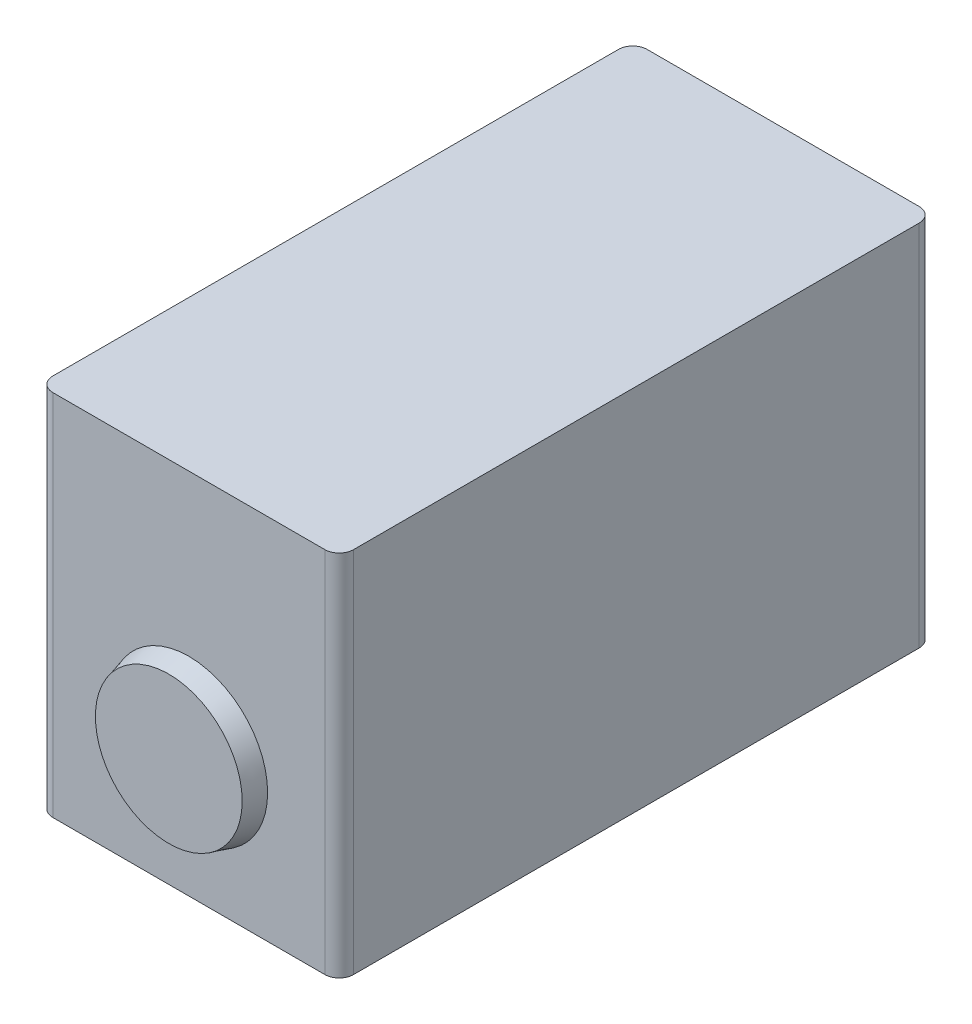
ISO-10303-21;
HEADER;
FILE_DESCRIPTION(('STEP AP214'),'2;1');
FILE_NAME('part.step','',(''),(''),'','','');
FILE_SCHEMA(('AUTOMOTIVE_DESIGN { 1 0 10303 214 1 1 1 1 }'));
ENDSEC;
DATA;
#1=APPLICATION_CONTEXT('core data for automotive mechanical design processes');
#2=APPLICATION_PROTOCOL_DEFINITION('international standard','automotive_design',2000,#1);
#3=PRODUCT_CONTEXT('',#1,'mechanical');
#4=PRODUCT('Part','Part','',(#3));
#5=PRODUCT_RELATED_PRODUCT_CATEGORY('part','',(#4));
#6=PRODUCT_DEFINITION_FORMATION('','',#4);
#7=PRODUCT_DEFINITION_CONTEXT('part definition',#1,'design');
#8=PRODUCT_DEFINITION('design','',#6,#7);
#9=PRODUCT_DEFINITION_SHAPE('','',#8);
#10=(LENGTH_UNIT() NAMED_UNIT(*) SI_UNIT(.MILLI.,.METRE.));
#11=(NAMED_UNIT(*) PLANE_ANGLE_UNIT() SI_UNIT($,.RADIAN.));
#12=(NAMED_UNIT(*) SI_UNIT($,.STERADIAN.) SOLID_ANGLE_UNIT());
#13=UNCERTAINTY_MEASURE_WITH_UNIT(LENGTH_MEASURE(1.E-05),#10,'distance_accuracy_value','');
#14=(GEOMETRIC_REPRESENTATION_CONTEXT(3) GLOBAL_UNCERTAINTY_ASSIGNED_CONTEXT((#13)) GLOBAL_UNIT_ASSIGNED_CONTEXT((#10,
#11,#12)) REPRESENTATION_CONTEXT('',''));
#15=CARTESIAN_POINT('',(0.,0.,0.));
#16=DIRECTION('',(0.,0.,1.));
#17=DIRECTION('',(1.,0.,0.));
#18=AXIS2_PLACEMENT_3D('',#15,#16,#17);
#19=CARTESIAN_POINT('',(10.5,25.7,20.75));
#20=DIRECTION('',(0.,0.,-1.));
#21=DIRECTION('',(-1.,0.,0.));
#22=AXIS2_PLACEMENT_3D('',#19,#20,#21);
#23=PLANE('',#22);
#24=DIRECTION('',(1.,0.,0.));
#25=VECTOR('',#24,1.);
#26=CARTESIAN_POINT('',(10.5,25.7,20.75));
#27=LINE('',#26,#25);
#28=CARTESIAN_POINT('',(-9.5,25.7,20.75));
#29=VERTEX_POINT('',#28);
#30=CARTESIAN_POINT('',(9.5,25.7,20.75));
#31=VERTEX_POINT('',#30);
#32=EDGE_CURVE('E181',#29,#31,#27,.T.);
#33=ORIENTED_EDGE('',*,*,#32,.F.);
#34=DIRECTION('',(0.,-1.,0.));
#35=VECTOR('',#34,1.);
#36=CARTESIAN_POINT('',(-9.50000000000001,25.7,20.75));
#37=LINE('',#36,#35);
#38=CARTESIAN_POINT('',(-9.5,0.,20.75));
#39=VERTEX_POINT('',#38);
#40=EDGE_CURVE('E50',#29,#39,#37,.T.);
#41=ORIENTED_EDGE('',*,*,#40,.T.);
#42=DIRECTION('',(1.,0.,0.));
#43=VECTOR('',#42,1.);
#44=CARTESIAN_POINT('',(10.5,0.,20.75));
#45=LINE('',#44,#43);
#46=CARTESIAN_POINT('',(9.5,0.,20.75));
#47=VERTEX_POINT('',#46);
#48=EDGE_CURVE('E137',#39,#47,#45,.T.);
#49=ORIENTED_EDGE('',*,*,#48,.T.);
#50=DIRECTION('',(0.,-1.,0.));
#51=VECTOR('',#50,1.);
#52=CARTESIAN_POINT('',(9.5,25.7,20.75));
#53=LINE('',#52,#51);
#54=EDGE_CURVE('E174',#47,#31,#53,.F.);
#55=ORIENTED_EDGE('',*,*,#54,.T.);
#56=EDGE_LOOP('',(#33,#41,#49,#55));
#57=FACE_BOUND('',#56,.T.);
#58=CARTESIAN_POINT('',(0.,9.,20.75));
#59=DIRECTION('',(0.,0.,-1.));
#60=DIRECTION('',(-1.,0.,0.));
#61=AXIS2_PLACEMENT_3D('',#58,#59,#60);
#62=CIRCLE('',#61,5.5);
#63=CARTESIAN_POINT('',(-5.5,9.,20.75));
#64=VERTEX_POINT('',#63);
#65=EDGE_CURVE('E11',#64,#64,#62,.F.);
#66=ORIENTED_EDGE('',*,*,#65,.F.);
#67=EDGE_LOOP('',(#66));
#68=FACE_BOUND('',#67,.T.);
#69=ADVANCED_FACE('F42',(#57,#68),#23,.F.);
#70=CARTESIAN_POINT('',(-10.5,25.7,20.75));
#71=DIRECTION('',(1.,0.,0.));
#72=DIRECTION('',(0.,0.,-1.));
#73=AXIS2_PLACEMENT_3D('',#70,#71,#72);
#74=PLANE('',#73);
#75=DIRECTION('',(0.,0.,1.));
#76=VECTOR('',#75,1.);
#77=CARTESIAN_POINT('',(-10.5,25.7,20.75));
#78=LINE('',#77,#76);
#79=CARTESIAN_POINT('',(-10.5,25.7,-19.75));
#80=VERTEX_POINT('',#79);
#81=CARTESIAN_POINT('',(-10.5,25.7,19.75));
#82=VERTEX_POINT('',#81);
#83=EDGE_CURVE('E130',#80,#82,#78,.T.);
#84=ORIENTED_EDGE('',*,*,#83,.F.);
#85=DIRECTION('',(0.,-1.,0.));
#86=VECTOR('',#85,1.);
#87=CARTESIAN_POINT('',(-10.5,25.7,-19.75));
#88=LINE('',#87,#86);
#89=CARTESIAN_POINT('',(-10.5,0.,-19.75));
#90=VERTEX_POINT('',#89);
#91=EDGE_CURVE('E114',#80,#90,#88,.T.);
#92=ORIENTED_EDGE('',*,*,#91,.T.);
#93=DIRECTION('',(0.,0.,1.));
#94=VECTOR('',#93,1.);
#95=CARTESIAN_POINT('',(-10.5,0.,20.75));
#96=LINE('',#95,#94);
#97=CARTESIAN_POINT('',(-10.5,0.,19.75));
#98=VERTEX_POINT('',#97);
#99=EDGE_CURVE('E127',#90,#98,#96,.T.);
#100=ORIENTED_EDGE('',*,*,#99,.T.);
#101=DIRECTION('',(0.,-1.,0.));
#102=VECTOR('',#101,1.);
#103=CARTESIAN_POINT('',(-10.5,25.7,19.75));
#104=LINE('',#103,#102);
#105=EDGE_CURVE('E132',#98,#82,#104,.F.);
#106=ORIENTED_EDGE('',*,*,#105,.T.);
#107=EDGE_LOOP('',(#84,#92,#100,#106));
#108=FACE_BOUND('',#107,.T.);
#109=ADVANCED_FACE('F126',(#108),#74,.F.);
#110=CARTESIAN_POINT('',(10.5,25.7,20.75));
#111=DIRECTION('',(-1.,0.,0.));
#112=DIRECTION('',(0.,0.,1.));
#113=AXIS2_PLACEMENT_3D('',#110,#111,#112);
#114=PLANE('',#113);
#115=DIRECTION('',(0.,0.,-1.));
#116=VECTOR('',#115,1.);
#117=CARTESIAN_POINT('',(10.5,0.,20.75));
#118=LINE('',#117,#116);
#119=CARTESIAN_POINT('',(10.5,0.,19.75));
#120=VERTEX_POINT('',#119);
#121=CARTESIAN_POINT('',(10.5,0.,-19.75));
#122=VERTEX_POINT('',#121);
#123=EDGE_CURVE('E141',#120,#122,#118,.T.);
#124=ORIENTED_EDGE('',*,*,#123,.T.);
#125=DIRECTION('',(0.,-1.,0.));
#126=VECTOR('',#125,1.);
#127=CARTESIAN_POINT('',(10.5,25.7,-19.75));
#128=LINE('',#127,#126);
#129=CARTESIAN_POINT('',(10.5,25.7,-19.75));
#130=VERTEX_POINT('',#129);
#131=EDGE_CURVE('E57',#122,#130,#128,.F.);
#132=ORIENTED_EDGE('',*,*,#131,.T.);
#133=DIRECTION('',(0.,0.,-1.));
#134=VECTOR('',#133,1.);
#135=CARTESIAN_POINT('',(10.5,25.7,20.75));
#136=LINE('',#135,#134);
#137=CARTESIAN_POINT('',(10.5,25.7,19.75));
#138=VERTEX_POINT('',#137);
#139=EDGE_CURVE('E188',#138,#130,#136,.T.);
#140=ORIENTED_EDGE('',*,*,#139,.F.);
#141=DIRECTION('',(0.,-1.,0.));
#142=VECTOR('',#141,1.);
#143=CARTESIAN_POINT('',(10.5,25.7,19.75));
#144=LINE('',#143,#142);
#145=EDGE_CURVE('E169',#138,#120,#144,.T.);
#146=ORIENTED_EDGE('',*,*,#145,.T.);
#147=EDGE_LOOP('',(#124,#132,#140,#146));
#148=FACE_BOUND('',#147,.T.);
#149=ADVANCED_FACE('F187',(#148),#114,.F.);
#150=CARTESIAN_POINT('',(10.5,25.7,-20.75));
#151=DIRECTION('',(0.,0.,1.));
#152=DIRECTION('',(1.,0.,0.));
#153=AXIS2_PLACEMENT_3D('',#150,#151,#152);
#154=PLANE('',#153);
#155=DIRECTION('',(-1.,0.,0.));
#156=VECTOR('',#155,1.);
#157=CARTESIAN_POINT('',(10.5,0.,-20.75));
#158=LINE('',#157,#156);
#159=CARTESIAN_POINT('',(9.5,0.,-20.75));
#160=VERTEX_POINT('',#159);
#161=CARTESIAN_POINT('',(-9.5,0.,-20.75));
#162=VERTEX_POINT('',#161);
#163=EDGE_CURVE('E151',#160,#162,#158,.T.);
#164=ORIENTED_EDGE('',*,*,#163,.T.);
#165=DIRECTION('',(0.,-1.,0.));
#166=VECTOR('',#165,1.);
#167=CARTESIAN_POINT('',(-9.50000000000001,25.7,-20.75));
#168=LINE('',#167,#166);
#169=CARTESIAN_POINT('',(-9.5,25.7,-20.75));
#170=VERTEX_POINT('',#169);
#171=EDGE_CURVE('E115',#162,#170,#168,.F.);
#172=ORIENTED_EDGE('',*,*,#171,.T.);
#173=DIRECTION('',(-1.,0.,0.));
#174=VECTOR('',#173,1.);
#175=CARTESIAN_POINT('',(10.5,25.7,-20.75));
#176=LINE('',#175,#174);
#177=CARTESIAN_POINT('',(9.5,25.7,-20.75));
#178=VERTEX_POINT('',#177);
#179=EDGE_CURVE('E146',#178,#170,#176,.T.);
#180=ORIENTED_EDGE('',*,*,#179,.F.);
#181=DIRECTION('',(0.,-1.,0.));
#182=VECTOR('',#181,1.);
#183=CARTESIAN_POINT('',(9.5,25.7,-20.75));
#184=LINE('',#183,#182);
#185=EDGE_CURVE('E120',#178,#160,#184,.T.);
#186=ORIENTED_EDGE('',*,*,#185,.T.);
#187=EDGE_LOOP('',(#164,#172,#180,#186));
#188=FACE_BOUND('',#187,.T.);
#189=ADVANCED_FACE('F221',(#188),#154,.F.);
#190=CARTESIAN_POINT('',(-10.5,25.7,-20.75));
#191=DIRECTION('',(0.,1.,0.));
#192=DIRECTION('',(0.,0.,1.));
#193=AXIS2_PLACEMENT_3D('',#190,#191,#192);
#194=PLANE('',#193);
#195=ORIENTED_EDGE('',*,*,#179,.T.);
#196=CARTESIAN_POINT('',(-9.5,25.7,-19.75));
#197=DIRECTION('',(0.,1.,0.));
#198=DIRECTION('',(0.,0.,1.));
#199=AXIS2_PLACEMENT_3D('',#196,#197,#198);
#200=CIRCLE('',#199,1.);
#201=EDGE_CURVE('E167',#170,#80,#200,.T.);
#202=ORIENTED_EDGE('',*,*,#201,.T.);
#203=ORIENTED_EDGE('',*,*,#83,.T.);
#204=CARTESIAN_POINT('',(-9.50000000000001,25.7,19.75));
#205=DIRECTION('',(0.,1.,0.));
#206=DIRECTION('',(0.,0.,1.));
#207=AXIS2_PLACEMENT_3D('',#204,#205,#206);
#208=CIRCLE('',#207,1.);
#209=EDGE_CURVE('E163',#82,#29,#208,.T.);
#210=ORIENTED_EDGE('',*,*,#209,.T.);
#211=ORIENTED_EDGE('',*,*,#32,.T.);
#212=CARTESIAN_POINT('',(9.5,25.7,19.75));
#213=DIRECTION('',(0.,1.,0.));
#214=DIRECTION('',(0.,0.,1.));
#215=AXIS2_PLACEMENT_3D('',#212,#213,#214);
#216=CIRCLE('',#215,1.);
#217=EDGE_CURVE('E64',#31,#138,#216,.T.);
#218=ORIENTED_EDGE('',*,*,#217,.T.);
#219=ORIENTED_EDGE('',*,*,#139,.T.);
#220=CARTESIAN_POINT('',(9.5,25.7,-19.75));
#221=DIRECTION('',(0.,1.,0.));
#222=DIRECTION('',(0.,0.,1.));
#223=AXIS2_PLACEMENT_3D('',#220,#221,#222);
#224=CIRCLE('',#223,1.);
#225=EDGE_CURVE('E165',#130,#178,#224,.T.);
#226=ORIENTED_EDGE('',*,*,#225,.T.);
#227=EDGE_LOOP('',(#195,#202,#203,#210,#211,#218,#219,#226));
#228=FACE_BOUND('',#227,.T.);
#229=ADVANCED_FACE('F193',(#228),#194,.T.);
#230=CARTESIAN_POINT('',(-10.5,0.,-20.75));
#231=DIRECTION('',(0.,1.,0.));
#232=DIRECTION('',(0.,0.,1.));
#233=AXIS2_PLACEMENT_3D('',#230,#231,#232);
#234=PLANE('',#233);
#235=ORIENTED_EDGE('',*,*,#99,.F.);
#236=CARTESIAN_POINT('',(-9.5,0.,-19.75));
#237=DIRECTION('',(0.,1.,0.));
#238=DIRECTION('',(0.,0.,1.));
#239=AXIS2_PLACEMENT_3D('',#236,#237,#238);
#240=CIRCLE('',#239,1.);
#241=EDGE_CURVE('E110',#90,#162,#240,.F.);
#242=ORIENTED_EDGE('',*,*,#241,.T.);
#243=ORIENTED_EDGE('',*,*,#163,.F.);
#244=CARTESIAN_POINT('',(9.5,0.,-19.75));
#245=DIRECTION('',(0.,1.,0.));
#246=DIRECTION('',(0.,0.,1.));
#247=AXIS2_PLACEMENT_3D('',#244,#245,#246);
#248=CIRCLE('',#247,1.);
#249=EDGE_CURVE('E121',#160,#122,#248,.F.);
#250=ORIENTED_EDGE('',*,*,#249,.T.);
#251=ORIENTED_EDGE('',*,*,#123,.F.);
#252=CARTESIAN_POINT('',(9.5,0.,19.75));
#253=DIRECTION('',(0.,1.,0.));
#254=DIRECTION('',(0.,0.,1.));
#255=AXIS2_PLACEMENT_3D('',#252,#253,#254);
#256=CIRCLE('',#255,1.);
#257=EDGE_CURVE('E131',#120,#47,#256,.F.);
#258=ORIENTED_EDGE('',*,*,#257,.T.);
#259=ORIENTED_EDGE('',*,*,#48,.F.);
#260=CARTESIAN_POINT('',(-9.50000000000001,0.,19.75));
#261=DIRECTION('',(0.,1.,0.));
#262=DIRECTION('',(0.,0.,1.));
#263=AXIS2_PLACEMENT_3D('',#260,#261,#262);
#264=CIRCLE('',#263,1.);
#265=EDGE_CURVE('E136',#39,#98,#264,.F.);
#266=ORIENTED_EDGE('',*,*,#265,.T.);
#267=EDGE_LOOP('',(#235,#242,#243,#250,#251,#258,#259,#266));
#268=FACE_BOUND('',#267,.T.);
#269=ADVANCED_FACE('F134',(#268),#234,.F.);
#270=CARTESIAN_POINT('',(-9.5,25.7,-19.75));
#271=DIRECTION('',(0.,-1.,0.));
#272=DIRECTION('',(0.,0.,-1.));
#273=AXIS2_PLACEMENT_3D('',#270,#271,#272);
#274=CYLINDRICAL_SURFACE('',#273,1.);
#275=ORIENTED_EDGE('',*,*,#201,.F.);
#276=ORIENTED_EDGE('',*,*,#171,.F.);
#277=ORIENTED_EDGE('',*,*,#241,.F.);
#278=ORIENTED_EDGE('',*,*,#91,.F.);
#279=EDGE_LOOP('',(#275,#276,#277,#278));
#280=FACE_BOUND('',#279,.T.);
#281=ADVANCED_FACE('F113',(#280),#274,.T.);
#282=CARTESIAN_POINT('',(9.5,25.7,-19.75));
#283=DIRECTION('',(0.,-1.,0.));
#284=DIRECTION('',(0.,0.,-1.));
#285=AXIS2_PLACEMENT_3D('',#282,#283,#284);
#286=CYLINDRICAL_SURFACE('',#285,1.);
#287=ORIENTED_EDGE('',*,*,#225,.F.);
#288=ORIENTED_EDGE('',*,*,#131,.F.);
#289=ORIENTED_EDGE('',*,*,#249,.F.);
#290=ORIENTED_EDGE('',*,*,#185,.F.);
#291=EDGE_LOOP('',(#287,#288,#289,#290));
#292=FACE_BOUND('',#291,.T.);
#293=ADVANCED_FACE('F196',(#292),#286,.T.);
#294=CARTESIAN_POINT('',(-9.50000000000001,25.7,19.75));
#295=DIRECTION('',(0.,-1.,0.));
#296=DIRECTION('',(0.,0.,-1.));
#297=AXIS2_PLACEMENT_3D('',#294,#295,#296);
#298=CYLINDRICAL_SURFACE('',#297,1.);
#299=ORIENTED_EDGE('',*,*,#209,.F.);
#300=ORIENTED_EDGE('',*,*,#105,.F.);
#301=ORIENTED_EDGE('',*,*,#265,.F.);
#302=ORIENTED_EDGE('',*,*,#40,.F.);
#303=EDGE_LOOP('',(#299,#300,#301,#302));
#304=FACE_BOUND('',#303,.T.);
#305=ADVANCED_FACE('F194',(#304),#298,.T.);
#306=CARTESIAN_POINT('',(9.5,25.7,19.75));
#307=DIRECTION('',(0.,-1.,0.));
#308=DIRECTION('',(0.,0.,-1.));
#309=AXIS2_PLACEMENT_3D('',#306,#307,#308);
#310=CYLINDRICAL_SURFACE('',#309,1.);
#311=ORIENTED_EDGE('',*,*,#217,.F.);
#312=ORIENTED_EDGE('',*,*,#54,.F.);
#313=ORIENTED_EDGE('',*,*,#257,.F.);
#314=ORIENTED_EDGE('',*,*,#145,.F.);
#315=EDGE_LOOP('',(#311,#312,#313,#314));
#316=FACE_BOUND('',#315,.T.);
#317=ADVANCED_FACE('F44',(#316),#310,.T.);
#318=CARTESIAN_POINT('',(0.,9.,20.75));
#319=DIRECTION('',(0.,0.,-1.));
#320=DIRECTION('',(1.,0.,0.));
#321=AXIS2_PLACEMENT_3D('',#318,#319,#320);
#322=CONICAL_SURFACE('',#321,5.5,0.26179938779915);
#323=CARTESIAN_POINT('',(0.,9.,22.15));
#324=DIRECTION('',(0.,0.,1.));
#325=DIRECTION('',(1.,0.,0.));
#326=AXIS2_PLACEMENT_3D('',#323,#324,#325);
#327=CIRCLE('',#326,5.12487113059643);
#328=CARTESIAN_POINT('',(5.12487113059643,9.,22.15));
#329=VERTEX_POINT('',#328);
#330=EDGE_CURVE('E138',#329,#329,#327,.T.);
#331=ORIENTED_EDGE('',*,*,#330,.F.);
#332=EDGE_LOOP('',(#331));
#333=FACE_BOUND('',#332,.T.);
#334=ORIENTED_EDGE('',*,*,#65,.T.);
#335=EDGE_LOOP('',(#334));
#336=FACE_BOUND('',#335,.T.);
#337=ADVANCED_FACE('F201',(#333,#336),#322,.T.);
#338=CARTESIAN_POINT('',(0.,9.,22.15));
#339=DIRECTION('',(0.,0.,1.));
#340=DIRECTION('',(1.,0.,0.));
#341=AXIS2_PLACEMENT_3D('',#338,#339,#340);
#342=PLANE('',#341);
#343=ORIENTED_EDGE('',*,*,#330,.T.);
#344=EDGE_LOOP('',(#343));
#345=FACE_BOUND('',#344,.T.);
#346=ADVANCED_FACE('F289',(#345),#342,.T.);
#347=CLOSED_SHELL('',(#69,#109,#149,#189,#229,#269,#281,#293,#305,#317,#337,#346));
#348=MANIFOLD_SOLID_BREP('B2',#347);
#349=ADVANCED_BREP_SHAPE_REPRESENTATION('',(#18,#348),#14);
#350=SHAPE_DEFINITION_REPRESENTATION(#9,#349);
ENDSEC;
END-ISO-10303-21;
